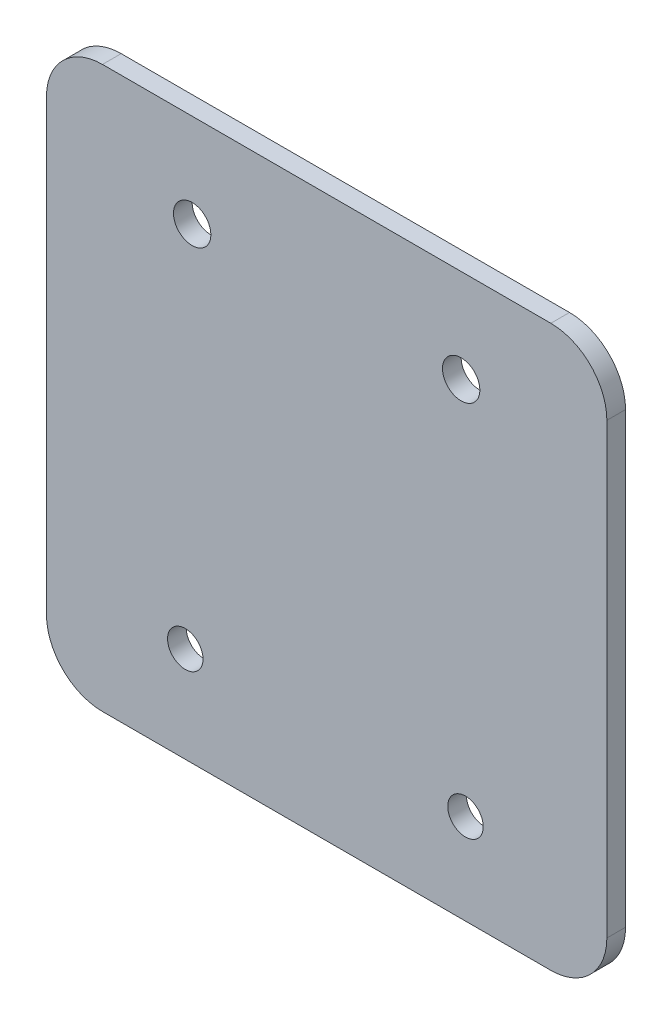
ISO-10303-21;
HEADER;
FILE_DESCRIPTION(('STEP AP214'),'2;1');
FILE_NAME('part.step','',(''),(''),'','','');
FILE_SCHEMA(('AUTOMOTIVE_DESIGN { 1 0 10303 214 1 1 1 1 }'));
ENDSEC;
DATA;
#1=APPLICATION_CONTEXT('core data for automotive mechanical design processes');
#2=APPLICATION_PROTOCOL_DEFINITION('international standard','automotive_design',2000,#1);
#3=PRODUCT_CONTEXT('',#1,'mechanical');
#4=PRODUCT('Part','Part','',(#3));
#5=PRODUCT_RELATED_PRODUCT_CATEGORY('part','',(#4));
#6=PRODUCT_DEFINITION_FORMATION('','',#4);
#7=PRODUCT_DEFINITION_CONTEXT('part definition',#1,'design');
#8=PRODUCT_DEFINITION('design','',#6,#7);
#9=PRODUCT_DEFINITION_SHAPE('','',#8);
#10=(LENGTH_UNIT() NAMED_UNIT(*) SI_UNIT(.MILLI.,.METRE.));
#11=(NAMED_UNIT(*) PLANE_ANGLE_UNIT() SI_UNIT($,.RADIAN.));
#12=(NAMED_UNIT(*) SI_UNIT($,.STERADIAN.) SOLID_ANGLE_UNIT());
#13=UNCERTAINTY_MEASURE_WITH_UNIT(LENGTH_MEASURE(1.E-05),#10,'distance_accuracy_value','');
#14=(GEOMETRIC_REPRESENTATION_CONTEXT(3) GLOBAL_UNCERTAINTY_ASSIGNED_CONTEXT((#13)) GLOBAL_UNIT_ASSIGNED_CONTEXT((#10,
#11,#12)) REPRESENTATION_CONTEXT('',''));
#15=CARTESIAN_POINT('',(0.,0.,0.));
#16=DIRECTION('',(0.,0.,1.));
#17=DIRECTION('',(1.,0.,0.));
#18=AXIS2_PLACEMENT_3D('',#15,#16,#17);
#19=CARTESIAN_POINT('',(-38.1,-38.1,2.54));
#20=DIRECTION('',(0.,0.,-1.));
#21=DIRECTION('',(-1.,0.,0.));
#22=AXIS2_PLACEMENT_3D('',#19,#20,#21);
#23=PLANE('',#22);
#24=CARTESIAN_POINT('',(18.8774590738346,-25.7892719236084,2.54000000000002));
#25=DIRECTION('',(0.,0.,1.));
#26=DIRECTION('',(-0.541576207585415,0.840651658760869,0.));
#27=AXIS2_PLACEMENT_3D('',#24,#25,#26);
#28=CIRCLE('',#27,2.413);
#29=CARTESIAN_POINT('',(17.570635684931,-23.7607794710185,2.54000000000002));
#30=VERTEX_POINT('',#29);
#31=EDGE_CURVE('E162',#30,#30,#28,.T.);
#32=ORIENTED_EDGE('',*,*,#31,.F.);
#33=EDGE_LOOP('',(#32));
#34=FACE_BOUND('',#33,.T.);
#35=CARTESIAN_POINT('',(-18.288,25.4,2.54));
#36=DIRECTION('',(0.,0.,1.));
#37=DIRECTION('',(1.,0.,0.));
#38=AXIS2_PLACEMENT_3D('',#35,#36,#37);
#39=CIRCLE('',#38,2.54);
#40=CARTESIAN_POINT('',(-15.748,25.4,2.54));
#41=VERTEX_POINT('',#40);
#42=EDGE_CURVE('E179',#41,#41,#39,.T.);
#43=ORIENTED_EDGE('',*,*,#42,.F.);
#44=EDGE_LOOP('',(#43));
#45=FACE_BOUND('',#44,.T.);
#46=DIRECTION('',(-1.,0.,0.));
#47=VECTOR('',#46,1.);
#48=CARTESIAN_POINT('',(38.1,38.1,2.54));
#49=LINE('',#48,#47);
#50=CARTESIAN_POINT('',(30.48,38.1,2.54));
#51=VERTEX_POINT('',#50);
#52=CARTESIAN_POINT('',(-30.48,38.1,2.54));
#53=VERTEX_POINT('',#52);
#54=EDGE_CURVE('E118',#51,#53,#49,.T.);
#55=ORIENTED_EDGE('',*,*,#54,.T.);
#56=CARTESIAN_POINT('',(-30.48,30.48,2.54));
#57=DIRECTION('',(0.,0.,-1.));
#58=DIRECTION('',(-1.,0.,0.));
#59=AXIS2_PLACEMENT_3D('',#56,#57,#58);
#60=CIRCLE('',#59,7.62);
#61=CARTESIAN_POINT('',(-38.1,30.48,2.54));
#62=VERTEX_POINT('',#61);
#63=EDGE_CURVE('E44',#53,#62,#60,.F.);
#64=ORIENTED_EDGE('',*,*,#63,.T.);
#65=DIRECTION('',(0.,-1.,0.));
#66=VECTOR('',#65,1.);
#67=CARTESIAN_POINT('',(-38.1,38.1,2.54));
#68=LINE('',#67,#66);
#69=CARTESIAN_POINT('',(-38.1,-30.48,2.54));
#70=VERTEX_POINT('',#69);
#71=EDGE_CURVE('E122',#62,#70,#68,.T.);
#72=ORIENTED_EDGE('',*,*,#71,.T.);
#73=CARTESIAN_POINT('',(-30.48,-30.48,2.54));
#74=DIRECTION('',(0.,0.,-1.));
#75=DIRECTION('',(-1.,0.,0.));
#76=AXIS2_PLACEMENT_3D('',#73,#74,#75);
#77=CIRCLE('',#76,7.62);
#78=CARTESIAN_POINT('',(-30.48,-38.1,2.54));
#79=VERTEX_POINT('',#78);
#80=EDGE_CURVE('E149',#70,#79,#77,.F.);
#81=ORIENTED_EDGE('',*,*,#80,.T.);
#82=DIRECTION('',(1.,0.,0.));
#83=VECTOR('',#82,1.);
#84=CARTESIAN_POINT('',(38.1,-38.1,2.54));
#85=LINE('',#84,#83);
#86=CARTESIAN_POINT('',(30.48,-38.1,2.54));
#87=VERTEX_POINT('',#86);
#88=EDGE_CURVE('E125',#79,#87,#85,.T.);
#89=ORIENTED_EDGE('',*,*,#88,.T.);
#90=CARTESIAN_POINT('',(30.48,-30.48,2.54));
#91=DIRECTION('',(0.,0.,-1.));
#92=DIRECTION('',(-1.,0.,0.));
#93=AXIS2_PLACEMENT_3D('',#90,#91,#92);
#94=CIRCLE('',#93,7.62);
#95=CARTESIAN_POINT('',(38.1,-30.48,2.54));
#96=VERTEX_POINT('',#95);
#97=EDGE_CURVE('E138',#87,#96,#94,.F.);
#98=ORIENTED_EDGE('',*,*,#97,.T.);
#99=DIRECTION('',(0.,1.,0.));
#100=VECTOR('',#99,1.);
#101=CARTESIAN_POINT('',(38.1,38.1,2.54));
#102=LINE('',#101,#100);
#103=CARTESIAN_POINT('',(38.1,30.48,2.54));
#104=VERTEX_POINT('',#103);
#105=EDGE_CURVE('E186',#96,#104,#102,.T.);
#106=ORIENTED_EDGE('',*,*,#105,.T.);
#107=CARTESIAN_POINT('',(30.48,30.48,2.54));
#108=DIRECTION('',(0.,0.,-1.));
#109=DIRECTION('',(-1.,0.,0.));
#110=AXIS2_PLACEMENT_3D('',#107,#108,#109);
#111=CIRCLE('',#110,7.62);
#112=EDGE_CURVE('E111',#104,#51,#111,.F.);
#113=ORIENTED_EDGE('',*,*,#112,.T.);
#114=EDGE_LOOP('',(#55,#64,#72,#81,#89,#98,#106,#113));
#115=FACE_BOUND('',#114,.T.);
#116=CARTESIAN_POINT('',(18.288,25.4,2.54));
#117=DIRECTION('',(0.,0.,1.));
#118=DIRECTION('',(1.,0.,0.));
#119=AXIS2_PLACEMENT_3D('',#116,#117,#118);
#120=CIRCLE('',#119,2.54);
#121=CARTESIAN_POINT('',(20.828,25.4,2.54));
#122=VERTEX_POINT('',#121);
#123=EDGE_CURVE('E166',#122,#122,#120,.T.);
#124=ORIENTED_EDGE('',*,*,#123,.F.);
#125=EDGE_LOOP('',(#124));
#126=FACE_BOUND('',#125,.T.);
#127=CARTESIAN_POINT('',(-19.2209546951105,-25.105760078365,2.54000000000002));
#128=DIRECTION('',(0.,0.,1.));
#129=DIRECTION('',(-0.245898368859535,-0.969295616513466,0.));
#130=AXIS2_PLACEMENT_3D('',#127,#128,#129);
#131=CIRCLE('',#130,2.413);
#132=CARTESIAN_POINT('',(-19.8143074591686,-27.444670401012,2.54000000000002));
#133=VERTEX_POINT('',#132);
#134=EDGE_CURVE('E173',#133,#133,#131,.T.);
#135=ORIENTED_EDGE('',*,*,#134,.F.);
#136=EDGE_LOOP('',(#135));
#137=FACE_BOUND('',#136,.T.);
#138=ADVANCED_FACE('F35',(#34,#45,#115,#126,#137),#23,.F.);
#139=CARTESIAN_POINT('',(-38.1,-38.1,0.));
#140=DIRECTION('',(0.,0.,-1.));
#141=DIRECTION('',(-1.,0.,0.));
#142=AXIS2_PLACEMENT_3D('',#139,#140,#141);
#143=PLANE('',#142);
#144=CARTESIAN_POINT('',(18.8774590738346,-25.7892719236084,0.));
#145=DIRECTION('',(0.,0.,-1.));
#146=DIRECTION('',(-1.,0.,0.));
#147=AXIS2_PLACEMENT_3D('',#144,#145,#146);
#148=CIRCLE('',#147,2.413);
#149=CARTESIAN_POINT('',(16.4644590738346,-25.7892719236084,0.));
#150=VERTEX_POINT('',#149);
#151=EDGE_CURVE('E159',#150,#150,#148,.F.);
#152=ORIENTED_EDGE('',*,*,#151,.T.);
#153=EDGE_LOOP('',(#152));
#154=FACE_BOUND('',#153,.T.);
#155=CARTESIAN_POINT('',(-18.288,25.4,0.));
#156=DIRECTION('',(0.,0.,1.));
#157=DIRECTION('',(1.,0.,0.));
#158=AXIS2_PLACEMENT_3D('',#155,#156,#157);
#159=CIRCLE('',#158,2.54);
#160=CARTESIAN_POINT('',(-15.748,25.4,0.));
#161=VERTEX_POINT('',#160);
#162=EDGE_CURVE('E177',#161,#161,#159,.T.);
#163=ORIENTED_EDGE('',*,*,#162,.T.);
#164=EDGE_LOOP('',(#163));
#165=FACE_BOUND('',#164,.T.);
#166=DIRECTION('',(0.,-1.,0.));
#167=VECTOR('',#166,1.);
#168=CARTESIAN_POINT('',(-38.1,38.1,0.));
#169=LINE('',#168,#167);
#170=CARTESIAN_POINT('',(-38.1,30.48,0.));
#171=VERTEX_POINT('',#170);
#172=CARTESIAN_POINT('',(-38.1,-30.48,0.));
#173=VERTEX_POINT('',#172);
#174=EDGE_CURVE('E182',#171,#173,#169,.T.);
#175=ORIENTED_EDGE('',*,*,#174,.F.);
#176=CARTESIAN_POINT('',(-30.48,30.48,0.));
#177=DIRECTION('',(0.,0.,-1.));
#178=DIRECTION('',(-1.,0.,0.));
#179=AXIS2_PLACEMENT_3D('',#176,#177,#178);
#180=CIRCLE('',#179,7.62);
#181=CARTESIAN_POINT('',(-30.48,38.1,0.));
#182=VERTEX_POINT('',#181);
#183=EDGE_CURVE('E11',#171,#182,#180,.T.);
#184=ORIENTED_EDGE('',*,*,#183,.T.);
#185=DIRECTION('',(-1.,0.,0.));
#186=VECTOR('',#185,1.);
#187=CARTESIAN_POINT('',(38.1,38.1,0.));
#188=LINE('',#187,#186);
#189=CARTESIAN_POINT('',(30.48,38.1,0.));
#190=VERTEX_POINT('',#189);
#191=EDGE_CURVE('E116',#190,#182,#188,.T.);
#192=ORIENTED_EDGE('',*,*,#191,.F.);
#193=CARTESIAN_POINT('',(30.48,30.48,0.));
#194=DIRECTION('',(0.,0.,-1.));
#195=DIRECTION('',(-1.,0.,0.));
#196=AXIS2_PLACEMENT_3D('',#193,#194,#195);
#197=CIRCLE('',#196,7.62);
#198=CARTESIAN_POINT('',(38.1,30.48,0.));
#199=VERTEX_POINT('',#198);
#200=EDGE_CURVE('E101',#190,#199,#197,.T.);
#201=ORIENTED_EDGE('',*,*,#200,.T.);
#202=DIRECTION('',(0.,1.,0.));
#203=VECTOR('',#202,1.);
#204=CARTESIAN_POINT('',(38.1,38.1,0.));
#205=LINE('',#204,#203);
#206=CARTESIAN_POINT('',(38.1,-30.48,0.));
#207=VERTEX_POINT('',#206);
#208=EDGE_CURVE('E123',#207,#199,#205,.T.);
#209=ORIENTED_EDGE('',*,*,#208,.F.);
#210=CARTESIAN_POINT('',(30.48,-30.48,0.));
#211=DIRECTION('',(0.,0.,-1.));
#212=DIRECTION('',(-1.,0.,0.));
#213=AXIS2_PLACEMENT_3D('',#210,#211,#212);
#214=CIRCLE('',#213,7.62);
#215=CARTESIAN_POINT('',(30.48,-38.1,0.));
#216=VERTEX_POINT('',#215);
#217=EDGE_CURVE('E140',#207,#216,#214,.T.);
#218=ORIENTED_EDGE('',*,*,#217,.T.);
#219=DIRECTION('',(1.,0.,0.));
#220=VECTOR('',#219,1.);
#221=CARTESIAN_POINT('',(38.1,-38.1,0.));
#222=LINE('',#221,#220);
#223=CARTESIAN_POINT('',(-30.48,-38.1,0.));
#224=VERTEX_POINT('',#223);
#225=EDGE_CURVE('E127',#224,#216,#222,.T.);
#226=ORIENTED_EDGE('',*,*,#225,.F.);
#227=CARTESIAN_POINT('',(-30.48,-30.48,0.));
#228=DIRECTION('',(0.,0.,-1.));
#229=DIRECTION('',(-1.,0.,0.));
#230=AXIS2_PLACEMENT_3D('',#227,#228,#229);
#231=CIRCLE('',#230,7.62);
#232=EDGE_CURVE('E151',#224,#173,#231,.T.);
#233=ORIENTED_EDGE('',*,*,#232,.T.);
#234=EDGE_LOOP('',(#175,#184,#192,#201,#209,#218,#226,#233));
#235=FACE_BOUND('',#234,.T.);
#236=CARTESIAN_POINT('',(18.288,25.4,0.));
#237=DIRECTION('',(0.,0.,1.));
#238=DIRECTION('',(1.,0.,0.));
#239=AXIS2_PLACEMENT_3D('',#236,#237,#238);
#240=CIRCLE('',#239,2.54);
#241=CARTESIAN_POINT('',(20.828,25.4,0.));
#242=VERTEX_POINT('',#241);
#243=EDGE_CURVE('E161',#242,#242,#240,.T.);
#244=ORIENTED_EDGE('',*,*,#243,.T.);
#245=EDGE_LOOP('',(#244));
#246=FACE_BOUND('',#245,.T.);
#247=CARTESIAN_POINT('',(-19.2209546951105,-25.105760078365,0.));
#248=DIRECTION('',(0.,0.,-1.));
#249=DIRECTION('',(-1.,0.,0.));
#250=AXIS2_PLACEMENT_3D('',#247,#248,#249);
#251=CIRCLE('',#250,2.413);
#252=CARTESIAN_POINT('',(-19.8143074591686,-27.444670401012,0.));
#253=VERTEX_POINT('',#252);
#254=EDGE_CURVE('E39',#253,#253,#251,.F.);
#255=ORIENTED_EDGE('',*,*,#254,.T.);
#256=EDGE_LOOP('',(#255));
#257=FACE_BOUND('',#256,.T.);
#258=ADVANCED_FACE('F120',(#154,#165,#235,#246,#257),#143,.T.);
#259=CARTESIAN_POINT('',(-30.48,30.48,2.54));
#260=DIRECTION('',(0.,0.,-1.));
#261=DIRECTION('',(-1.,0.,0.));
#262=AXIS2_PLACEMENT_3D('',#259,#260,#261);
#263=CYLINDRICAL_SURFACE('',#262,7.62);
#264=DIRECTION('',(0.,0.,-1.));
#265=VECTOR('',#264,1.);
#266=CARTESIAN_POINT('',(-38.1,30.48,2.54));
#267=LINE('',#266,#265);
#268=EDGE_CURVE('E154',#62,#171,#267,.T.);
#269=ORIENTED_EDGE('',*,*,#268,.F.);
#270=ORIENTED_EDGE('',*,*,#63,.F.);
#271=DIRECTION('',(0.,0.,-1.));
#272=VECTOR('',#271,1.);
#273=CARTESIAN_POINT('',(-30.48,38.1,2.54));
#274=LINE('',#273,#272);
#275=EDGE_CURVE('E157',#182,#53,#274,.F.);
#276=ORIENTED_EDGE('',*,*,#275,.F.);
#277=ORIENTED_EDGE('',*,*,#183,.F.);
#278=EDGE_LOOP('',(#269,#270,#276,#277));
#279=FACE_BOUND('',#278,.T.);
#280=ADVANCED_FACE('F37',(#279),#263,.T.);
#281=CARTESIAN_POINT('',(-30.48,-30.48,2.54));
#282=DIRECTION('',(0.,0.,-1.));
#283=DIRECTION('',(-1.,0.,0.));
#284=AXIS2_PLACEMENT_3D('',#281,#282,#283);
#285=CYLINDRICAL_SURFACE('',#284,7.62);
#286=DIRECTION('',(0.,0.,-1.));
#287=VECTOR('',#286,1.);
#288=CARTESIAN_POINT('',(-30.48,-38.1,2.54));
#289=LINE('',#288,#287);
#290=EDGE_CURVE('E143',#79,#224,#289,.T.);
#291=ORIENTED_EDGE('',*,*,#290,.F.);
#292=ORIENTED_EDGE('',*,*,#80,.F.);
#293=DIRECTION('',(0.,0.,-1.));
#294=VECTOR('',#293,1.);
#295=CARTESIAN_POINT('',(-38.1,-30.48,2.54));
#296=LINE('',#295,#294);
#297=EDGE_CURVE('E146',#173,#70,#296,.F.);
#298=ORIENTED_EDGE('',*,*,#297,.F.);
#299=ORIENTED_EDGE('',*,*,#232,.F.);
#300=EDGE_LOOP('',(#291,#292,#298,#299));
#301=FACE_BOUND('',#300,.T.);
#302=ADVANCED_FACE('F206',(#301),#285,.T.);
#303=CARTESIAN_POINT('',(30.48,-30.48,2.54));
#304=DIRECTION('',(0.,0.,-1.));
#305=DIRECTION('',(-1.,0.,0.));
#306=AXIS2_PLACEMENT_3D('',#303,#304,#305);
#307=CYLINDRICAL_SURFACE('',#306,7.62);
#308=DIRECTION('',(0.,0.,-1.));
#309=VECTOR('',#308,1.);
#310=CARTESIAN_POINT('',(38.1,-30.48,2.54));
#311=LINE('',#310,#309);
#312=EDGE_CURVE('E110',#96,#207,#311,.T.);
#313=ORIENTED_EDGE('',*,*,#312,.F.);
#314=ORIENTED_EDGE('',*,*,#97,.F.);
#315=DIRECTION('',(0.,0.,-1.));
#316=VECTOR('',#315,1.);
#317=CARTESIAN_POINT('',(30.48,-38.1,2.54));
#318=LINE('',#317,#316);
#319=EDGE_CURVE('E135',#216,#87,#318,.F.);
#320=ORIENTED_EDGE('',*,*,#319,.F.);
#321=ORIENTED_EDGE('',*,*,#217,.F.);
#322=EDGE_LOOP('',(#313,#314,#320,#321));
#323=FACE_BOUND('',#322,.T.);
#324=ADVANCED_FACE('F198',(#323),#307,.T.);
#325=CARTESIAN_POINT('',(30.48,30.48,2.54));
#326=DIRECTION('',(0.,0.,-1.));
#327=DIRECTION('',(-1.,0.,0.));
#328=AXIS2_PLACEMENT_3D('',#325,#326,#327);
#329=CYLINDRICAL_SURFACE('',#328,7.62);
#330=DIRECTION('',(0.,0.,-1.));
#331=VECTOR('',#330,1.);
#332=CARTESIAN_POINT('',(30.48,38.1,2.54));
#333=LINE('',#332,#331);
#334=EDGE_CURVE('E105',#51,#190,#333,.T.);
#335=ORIENTED_EDGE('',*,*,#334,.F.);
#336=ORIENTED_EDGE('',*,*,#112,.F.);
#337=DIRECTION('',(0.,0.,-1.));
#338=VECTOR('',#337,1.);
#339=CARTESIAN_POINT('',(38.1,30.48,2.54));
#340=LINE('',#339,#338);
#341=EDGE_CURVE('E108',#199,#104,#340,.F.);
#342=ORIENTED_EDGE('',*,*,#341,.F.);
#343=ORIENTED_EDGE('',*,*,#200,.F.);
#344=EDGE_LOOP('',(#335,#336,#342,#343));
#345=FACE_BOUND('',#344,.T.);
#346=ADVANCED_FACE('F103',(#345),#329,.T.);
#347=CARTESIAN_POINT('',(-38.1,38.1,2.54));
#348=DIRECTION('',(1.,0.,0.));
#349=DIRECTION('',(0.,1.,0.));
#350=AXIS2_PLACEMENT_3D('',#347,#348,#349);
#351=PLANE('',#350);
#352=ORIENTED_EDGE('',*,*,#71,.F.);
#353=ORIENTED_EDGE('',*,*,#268,.T.);
#354=ORIENTED_EDGE('',*,*,#174,.T.);
#355=ORIENTED_EDGE('',*,*,#297,.T.);
#356=EDGE_LOOP('',(#352,#353,#354,#355));
#357=FACE_BOUND('',#356,.T.);
#358=ADVANCED_FACE('F208',(#357),#351,.F.);
#359=CARTESIAN_POINT('',(38.1,-38.1,2.54));
#360=DIRECTION('',(0.,1.,0.));
#361=DIRECTION('',(-1.,0.,0.));
#362=AXIS2_PLACEMENT_3D('',#359,#360,#361);
#363=PLANE('',#362);
#364=ORIENTED_EDGE('',*,*,#88,.F.);
#365=ORIENTED_EDGE('',*,*,#290,.T.);
#366=ORIENTED_EDGE('',*,*,#225,.T.);
#367=ORIENTED_EDGE('',*,*,#319,.T.);
#368=EDGE_LOOP('',(#364,#365,#366,#367));
#369=FACE_BOUND('',#368,.T.);
#370=ADVANCED_FACE('F192',(#369),#363,.F.);
#371=CARTESIAN_POINT('',(38.1,38.1,2.54));
#372=DIRECTION('',(-1.,0.,0.));
#373=DIRECTION('',(0.,-1.,0.));
#374=AXIS2_PLACEMENT_3D('',#371,#372,#373);
#375=PLANE('',#374);
#376=ORIENTED_EDGE('',*,*,#105,.F.);
#377=ORIENTED_EDGE('',*,*,#312,.T.);
#378=ORIENTED_EDGE('',*,*,#208,.T.);
#379=ORIENTED_EDGE('',*,*,#341,.T.);
#380=EDGE_LOOP('',(#376,#377,#378,#379));
#381=FACE_BOUND('',#380,.T.);
#382=ADVANCED_FACE('F210',(#381),#375,.F.);
#383=CARTESIAN_POINT('',(38.1,38.1,2.54));
#384=DIRECTION('',(0.,-1.,0.));
#385=DIRECTION('',(0.,0.,-1.));
#386=AXIS2_PLACEMENT_3D('',#383,#384,#385);
#387=PLANE('',#386);
#388=ORIENTED_EDGE('',*,*,#191,.T.);
#389=ORIENTED_EDGE('',*,*,#275,.T.);
#390=ORIENTED_EDGE('',*,*,#54,.F.);
#391=ORIENTED_EDGE('',*,*,#334,.T.);
#392=EDGE_LOOP('',(#388,#389,#390,#391));
#393=FACE_BOUND('',#392,.T.);
#394=ADVANCED_FACE('F115',(#393),#387,.F.);
#395=CARTESIAN_POINT('',(-18.288,25.4,2.54));
#396=DIRECTION('',(0.,0.,-1.));
#397=DIRECTION('',(-1.,0.,0.));
#398=AXIS2_PLACEMENT_3D('',#395,#396,#397);
#399=CYLINDRICAL_SURFACE('',#398,2.54);
#400=ORIENTED_EDGE('',*,*,#42,.T.);
#401=EDGE_LOOP('',(#400));
#402=FACE_BOUND('',#401,.T.);
#403=ORIENTED_EDGE('',*,*,#162,.F.);
#404=EDGE_LOOP('',(#403));
#405=FACE_BOUND('',#404,.T.);
#406=ADVANCED_FACE('F217',(#402,#405),#399,.F.);
#407=CARTESIAN_POINT('',(18.288,25.4,2.54));
#408=DIRECTION('',(0.,0.,-1.));
#409=DIRECTION('',(-1.,0.,0.));
#410=AXIS2_PLACEMENT_3D('',#407,#408,#409);
#411=CYLINDRICAL_SURFACE('',#410,2.54);
#412=ORIENTED_EDGE('',*,*,#123,.T.);
#413=EDGE_LOOP('',(#412));
#414=FACE_BOUND('',#413,.T.);
#415=ORIENTED_EDGE('',*,*,#243,.F.);
#416=EDGE_LOOP('',(#415));
#417=FACE_BOUND('',#416,.T.);
#418=ADVANCED_FACE('F232',(#414,#417),#411,.F.);
#419=CARTESIAN_POINT('',(18.8774590738346,-25.7892719236084,6.01980000000002));
#420=DIRECTION('',(0.,0.,1.));
#421=DIRECTION('',(-0.541576207585415,0.840651658760869,0.));
#422=AXIS2_PLACEMENT_3D('',#419,#420,#421);
#423=CYLINDRICAL_SURFACE('',#422,2.413);
#424=ORIENTED_EDGE('',*,*,#151,.F.);
#425=EDGE_LOOP('',(#424));
#426=FACE_BOUND('',#425,.T.);
#427=ORIENTED_EDGE('',*,*,#31,.T.);
#428=EDGE_LOOP('',(#427));
#429=FACE_BOUND('',#428,.T.);
#430=ADVANCED_FACE('F236',(#426,#429),#423,.F.);
#431=CARTESIAN_POINT('',(-19.2209546951105,-25.105760078365,6.01980000000002));
#432=DIRECTION('',(0.,0.,1.));
#433=DIRECTION('',(-0.245898368859535,-0.969295616513466,0.));
#434=AXIS2_PLACEMENT_3D('',#431,#432,#433);
#435=CYLINDRICAL_SURFACE('',#434,2.413);
#436=CARTESIAN_POINT('',(-19.8143074591686,-27.444670401012,0.));
#437=CARTESIAN_POINT('',(-19.8143074591686,-27.444670401012,0.0264583333333343));
#438=CARTESIAN_POINT('',(-19.8143074591686,-27.444670401012,0.0529166666666678));
#439=CARTESIAN_POINT('',(-19.8143074591686,-27.444670401012,0.105833333333335));
#440=CARTESIAN_POINT('',(-19.8143074591686,-27.444670401012,0.132291666666668));
#441=CARTESIAN_POINT('',(-19.8143074591686,-27.444670401012,0.185208333333335));
#442=CARTESIAN_POINT('',(-19.8143074591686,-27.444670401012,0.211666666666669));
#443=CARTESIAN_POINT('',(-19.8143074591686,-27.444670401012,0.264583333333336));
#444=CARTESIAN_POINT('',(-19.8143074591686,-27.444670401012,0.29104166666667));
#445=CARTESIAN_POINT('',(-19.8143074591686,-27.444670401012,0.343958333333337));
#446=CARTESIAN_POINT('',(-19.8143074591686,-27.444670401012,0.370416666666671));
#447=CARTESIAN_POINT('',(-19.8143074591686,-27.444670401012,0.423333333333337));
#448=CARTESIAN_POINT('',(-19.8143074591686,-27.444670401012,0.449791666666671));
#449=CARTESIAN_POINT('',(-19.8143074591686,-27.444670401012,0.502708333333338));
#450=CARTESIAN_POINT('',(-19.8143074591686,-27.444670401012,0.529166666666671));
#451=CARTESIAN_POINT('',(-19.8143074591686,-27.444670401012,0.582083333333338));
#452=CARTESIAN_POINT('',(-19.8143074591686,-27.444670401012,0.608541666666672));
#453=CARTESIAN_POINT('',(-19.8143074591686,-27.444670401012,0.661458333333339));
#454=CARTESIAN_POINT('',(-19.8143074591686,-27.444670401012,0.687916666666672));
#455=CARTESIAN_POINT('',(-19.8143074591686,-27.444670401012,0.74083333333334));
#456=CARTESIAN_POINT('',(-19.8143074591686,-27.444670401012,0.767291666666673));
#457=CARTESIAN_POINT('',(-19.8143074591686,-27.444670401012,0.820208333333341));
#458=CARTESIAN_POINT('',(-19.8143074591686,-27.444670401012,0.846666666666674));
#459=CARTESIAN_POINT('',(-19.8143074591686,-27.444670401012,0.899583333333341));
#460=CARTESIAN_POINT('',(-19.8143074591686,-27.444670401012,0.926041666666675));
#461=CARTESIAN_POINT('',(-19.8143074591686,-27.444670401012,0.978958333333341));
#462=CARTESIAN_POINT('',(-19.8143074591686,-27.444670401012,1.00541666666668));
#463=CARTESIAN_POINT('',(-19.8143074591686,-27.444670401012,1.05833333333334));
#464=CARTESIAN_POINT('',(-19.8143074591686,-27.444670401012,1.08479166666668));
#465=CARTESIAN_POINT('',(-19.8143074591686,-27.444670401012,1.13770833333334));
#466=CARTESIAN_POINT('',(-19.8143074591686,-27.444670401012,1.16416666666668));
#467=CARTESIAN_POINT('',(-19.8143074591686,-27.444670401012,1.21708333333334));
#468=CARTESIAN_POINT('',(-19.8143074591686,-27.444670401012,1.24354166666668));
#469=CARTESIAN_POINT('',(-19.8143074591686,-27.444670401012,1.29645833333334));
#470=CARTESIAN_POINT('',(-19.8143074591686,-27.444670401012,1.32291666666668));
#471=CARTESIAN_POINT('',(-19.8143074591686,-27.444670401012,1.37583333333334));
#472=CARTESIAN_POINT('',(-19.8143074591686,-27.444670401012,1.40229166666668));
#473=CARTESIAN_POINT('',(-19.8143074591686,-27.444670401012,1.45520833333334));
#474=CARTESIAN_POINT('',(-19.8143074591686,-27.444670401012,1.48166666666668));
#475=CARTESIAN_POINT('',(-19.8143074591686,-27.444670401012,1.53458333333335));
#476=CARTESIAN_POINT('',(-19.8143074591686,-27.444670401012,1.56104166666668));
#477=CARTESIAN_POINT('',(-19.8143074591686,-27.444670401012,1.61395833333335));
#478=CARTESIAN_POINT('',(-19.8143074591686,-27.444670401012,1.64041666666668));
#479=CARTESIAN_POINT('',(-19.8143074591686,-27.444670401012,1.69333333333335));
#480=CARTESIAN_POINT('',(-19.8143074591686,-27.444670401012,1.71979166666668));
#481=CARTESIAN_POINT('',(-19.8143074591686,-27.444670401012,1.77270833333335));
#482=CARTESIAN_POINT('',(-19.8143074591686,-27.444670401012,1.79916666666668));
#483=CARTESIAN_POINT('',(-19.8143074591686,-27.444670401012,1.85208333333335));
#484=CARTESIAN_POINT('',(-19.8143074591686,-27.444670401012,1.87854166666668));
#485=CARTESIAN_POINT('',(-19.8143074591686,-27.444670401012,1.93145833333335));
#486=CARTESIAN_POINT('',(-19.8143074591686,-27.444670401012,1.95791666666668));
#487=CARTESIAN_POINT('',(-19.8143074591686,-27.444670401012,2.01083333333335));
#488=CARTESIAN_POINT('',(-19.8143074591686,-27.444670401012,2.03729166666668));
#489=CARTESIAN_POINT('',(-19.8143074591686,-27.444670401012,2.09020833333335));
#490=CARTESIAN_POINT('',(-19.8143074591686,-27.444670401012,2.11666666666668));
#491=CARTESIAN_POINT('',(-19.8143074591686,-27.444670401012,2.16958333333335));
#492=CARTESIAN_POINT('',(-19.8143074591686,-27.444670401012,2.19604166666668));
#493=CARTESIAN_POINT('',(-19.8143074591686,-27.444670401012,2.24895833333335));
#494=CARTESIAN_POINT('',(-19.8143074591686,-27.444670401012,2.27541666666668));
#495=CARTESIAN_POINT('',(-19.8143074591686,-27.444670401012,2.32833333333335));
#496=CARTESIAN_POINT('',(-19.8143074591686,-27.444670401012,2.35479166666668));
#497=CARTESIAN_POINT('',(-19.8143074591686,-27.444670401012,2.40770833333335));
#498=CARTESIAN_POINT('',(-19.8143074591686,-27.444670401012,2.43416666666669));
#499=CARTESIAN_POINT('',(-19.8143074591686,-27.444670401012,2.48708333333335));
#500=CARTESIAN_POINT('',(-19.8143074591686,-27.444670401012,2.51354166666669));
#501=CARTESIAN_POINT('',(-19.8143074591686,-27.444670401012,2.54000000000002));
#502=B_SPLINE_CURVE_WITH_KNOTS('',3,(#436,#437,#438,#439,#440,#441,#442,#443,#444,#445,#446,
#447,#448,#449,#450,#451,#452,#453,#454,#455,#456,#457,#458,#459,#460,#461,#462,#463,#464,#465,
#466,#467,#468,#469,#470,#471,#472,#473,#474,#475,#476,#477,#478,#479,#480,#481,#482,#483,#484,
#485,#486,#487,#488,#489,#490,#491,#492,#493,#494,#495,#496,#497,#498,#499,#500,#501),
.UNSPECIFIED.,.F.,.F.,(4,2,2,2,2,2,2,2,2,2,2,2,2,2,2,2,2,2,2,2,2,2,2,2,2,2,2,2,2,2,2,2,4),(0.,
0.0793750000000004,0.158750000000001,0.238125000000001,0.317500000000003,0.396875000000003,
0.476250000000004,0.555625000000004,0.635000000000004,0.714375000000005,0.793750000000006,
0.873125000000007,0.952500000000007,1.03187500000001,1.11125000000001,1.19062500000001,
1.27000000000001,1.34937500000001,1.42875000000001,1.50812500000001,1.58750000000001,
1.66687500000001,1.74625000000001,1.82562500000001,1.90500000000001,1.98437500000001,
2.06375000000002,2.14312500000002,2.22250000000002,2.30187500000002,2.38125000000002,
2.46062500000002,2.54000000000002),.UNSPECIFIED.);
#503=EDGE_CURVE('BSEAM240',#253,#133,#502,.T.);
#504=ORIENTED_EDGE('',*,*,#254,.F.);
#505=ORIENTED_EDGE('',*,*,#134,.T.);
#506=ORIENTED_EDGE('',*,*,#503,.T.);
#507=ORIENTED_EDGE('',*,*,#503,.F.);
#508=EDGE_LOOP('',(#504,#506,#505,#507));
#509=FACE_BOUND('',#508,.T.);
#510=ADVANCED_FACE('F240',(#509),#435,.F.);
#511=CLOSED_SHELL('',(#138,#258,#280,#302,#324,#346,#358,#370,#382,#394,#406,#418,#430,#510));
#512=MANIFOLD_SOLID_BREP('B2',#511);
#513=ADVANCED_BREP_SHAPE_REPRESENTATION('',(#18,#512),#14);
#514=SHAPE_DEFINITION_REPRESENTATION(#9,#513);
ENDSEC;
END-ISO-10303-21;
